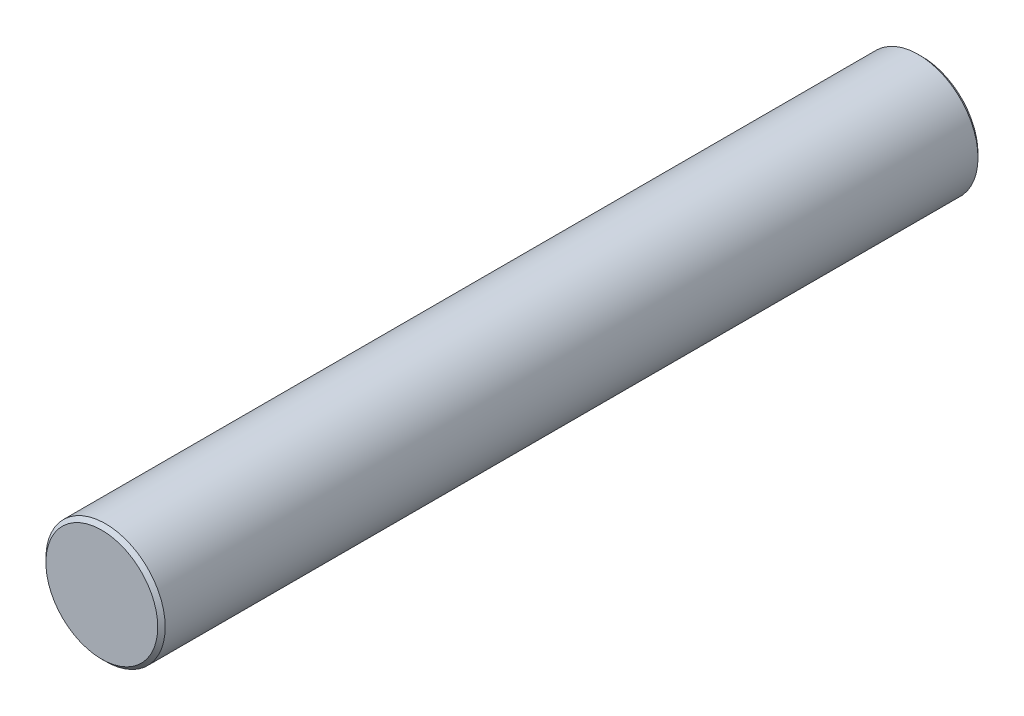
ISO-10303-21;
HEADER;
FILE_DESCRIPTION(('STEP AP214'),'2;1');
FILE_NAME('part.step','',(''),(''),'','','');
FILE_SCHEMA(('AUTOMOTIVE_DESIGN { 1 0 10303 214 1 1 1 1 }'));
ENDSEC;
DATA;
#1=APPLICATION_CONTEXT('core data for automotive mechanical design processes');
#2=APPLICATION_PROTOCOL_DEFINITION('international standard','automotive_design',2000,#1);
#3=PRODUCT_CONTEXT('',#1,'mechanical');
#4=PRODUCT('Part','Part','',(#3));
#5=PRODUCT_RELATED_PRODUCT_CATEGORY('part','',(#4));
#6=PRODUCT_DEFINITION_FORMATION('','',#4);
#7=PRODUCT_DEFINITION_CONTEXT('part definition',#1,'design');
#8=PRODUCT_DEFINITION('design','',#6,#7);
#9=PRODUCT_DEFINITION_SHAPE('','',#8);
#10=(LENGTH_UNIT() NAMED_UNIT(*) SI_UNIT(.MILLI.,.METRE.));
#11=(NAMED_UNIT(*) PLANE_ANGLE_UNIT() SI_UNIT($,.RADIAN.));
#12=(NAMED_UNIT(*) SI_UNIT($,.STERADIAN.) SOLID_ANGLE_UNIT());
#13=UNCERTAINTY_MEASURE_WITH_UNIT(LENGTH_MEASURE(1.E-05),#10,'distance_accuracy_value','');
#14=(GEOMETRIC_REPRESENTATION_CONTEXT(3) GLOBAL_UNCERTAINTY_ASSIGNED_CONTEXT((#13)) GLOBAL_UNIT_ASSIGNED_CONTEXT((#10,
#11,#12)) REPRESENTATION_CONTEXT('',''));
#15=CARTESIAN_POINT('',(0.,0.,0.));
#16=DIRECTION('',(0.,0.,1.));
#17=DIRECTION('',(1.,0.,0.));
#18=AXIS2_PLACEMENT_3D('',#15,#16,#17);
#19=CARTESIAN_POINT('',(-33.610628805,0.,55.));
#20=DIRECTION('',(0.,0.,-1.));
#21=DIRECTION('',(-1.,0.,0.));
#22=AXIS2_PLACEMENT_3D('',#19,#20,#21);
#23=CYLINDRICAL_SURFACE('',#22,8.00000000000001);
#24=CARTESIAN_POINT('',(-41.2891773767985,-2.24497034067952,48.4026196098586));
#25=CARTESIAN_POINT('',(-41.3204687050847,-2.13793919042912,48.2750508556962));
#26=CARTESIAN_POINT('',(-41.3524255672992,-2.02031474619086,48.1565549110275));
#27=CARTESIAN_POINT('',(-41.414241212432,-1.76653800619811,47.940762094698));
#28=CARTESIAN_POINT('',(-41.4441006114232,-1.63039118568655,47.8434589804289));
#29=CARTESIAN_POINT('',(-41.4985711947038,-1.34234083657794,47.6727508019051));
#30=CARTESIAN_POINT('',(-41.5231681730419,-1.1903962627548,47.5994101503956));
#31=CARTESIAN_POINT('',(-41.564199031048,-0.875170585825896,47.4797569209889));
#32=CARTESIAN_POINT('',(-41.5806361274108,-0.711893978881956,47.4334336913331));
#33=CARTESIAN_POINT('',(-41.6027988779069,-0.38763556682603,47.3714659893219));
#34=CARTESIAN_POINT('',(-41.6090309463019,-0.226966011589306,47.3543691034751));
#35=CARTESIAN_POINT('',(-41.6116828068893,0.0950450751442242,47.3470614357619));
#36=CARTESIAN_POINT('',(-41.6081050483967,0.256386428863146,47.3568439426572));
#37=CARTESIAN_POINT('',(-41.5919162091125,0.56772379887503,47.4018262019229));
#38=CARTESIAN_POINT('',(-41.5797079874793,0.717907116825453,47.4358929674807));
#39=CARTESIAN_POINT('',(-41.5479371538383,1.01033930953776,47.526884236615));
#40=CARTESIAN_POINT('',(-41.5283736904332,1.15258726356116,47.5838113864201));
#41=CARTESIAN_POINT('',(-41.4831243690139,1.42972242723955,47.7205846423869));
#42=CARTESIAN_POINT('',(-41.4572787730546,1.56428078209791,47.8010421804193));
#43=CARTESIAN_POINT('',(-41.4022759218393,1.81856776702252,47.9818182083398));
#44=CARTESIAN_POINT('',(-41.3731174793567,1.93829104829739,48.0821438279944));
#45=CARTESIAN_POINT('',(-41.3122725377233,2.16788337233966,48.307446819748));
#46=CARTESIAN_POINT('',(-41.2805465784894,2.27657322418578,48.433617421161));
#47=CARTESIAN_POINT('',(-41.2198606840384,2.47185661189762,48.7026657461835));
#48=CARTESIAN_POINT('',(-41.1909013214422,2.55844557956851,48.845546914938));
#49=CARTESIAN_POINT('',(-41.1384346832288,2.70899898259065,49.1481454706392));
#50=CARTESIAN_POINT('',(-41.1150741350813,2.77237369813639,49.3081834533896));
#51=CARTESIAN_POINT('',(-41.0777712852999,2.87134479223996,49.637655523364));
#52=CARTESIAN_POINT('',(-41.0638247602852,2.90695362842253,49.8070853601864));
#53=CARTESIAN_POINT('',(-41.0476656714241,2.94804146003936,50.1422363457774));
#54=CARTESIAN_POINT('',(-41.0449465799531,2.95482151162055,50.3077737897043));
#55=CARTESIAN_POINT('',(-41.0502070154145,2.94155179885308,50.6375812462188));
#56=CARTESIAN_POINT('',(-41.0581852396711,2.92150530133362,50.8018514106805));
#57=CARTESIAN_POINT('',(-41.0833947706818,2.85638208381296,51.1193300891844));
#58=CARTESIAN_POINT('',(-41.1003378321572,2.81208367236827,51.2727230186779));
#59=CARTESIAN_POINT('',(-41.1413087638498,2.70043977145201,51.5698649261916));
#60=CARTESIAN_POINT('',(-41.1653382325662,2.63308908146767,51.7136117193179));
#61=CARTESIAN_POINT('',(-41.2189397631446,2.47404531052235,51.9936227787521));
#62=CARTESIAN_POINT('',(-41.248694113262,2.38149136065889,52.1293628071604));
#63=CARTESIAN_POINT('',(-41.3098530013878,2.17565145475352,52.3837121269732));
#64=CARTESIAN_POINT('',(-41.3412580491566,2.06235906723167,52.5023160836032));
#65=CARTESIAN_POINT('',(-41.4037023310905,1.81251852801544,52.7238793676943));
#66=CARTESIAN_POINT('',(-41.4346746396574,1.67521146317903,52.8260053640328));
#67=CARTESIAN_POINT('',(-41.4913658328461,1.38416678497271,53.0052948009653));
#68=CARTESIAN_POINT('',(-41.5170859581959,1.23043306518826,53.0824641396136));
#69=CARTESIAN_POINT('',(-41.559550542838,0.915956648466314,53.2068664009787));
#70=CARTESIAN_POINT('',(-41.5765592282473,0.755603389010643,53.2549896684392));
#71=CARTESIAN_POINT('',(-41.6008350661672,0.428331647188945,53.323060064172));
#72=CARTESIAN_POINT('',(-41.6081071118696,0.261416505974415,53.3430213456475));
#73=CARTESIAN_POINT('',(-41.611916805897,-0.0624374120420378,53.3535127528464));
#74=CARTESIAN_POINT('',(-41.6091281212548,-0.219311384552947,53.3458898132852));
#75=CARTESIAN_POINT('',(-41.5946036809115,-0.529366582541286,53.305604168008));
#76=CARTESIAN_POINT('',(-41.5828683966596,-0.682548002162305,53.2729427817147));
#77=CARTESIAN_POINT('',(-41.5518594606401,-0.979218244793988,53.1843978927445));
#78=CARTESIAN_POINT('',(-41.5326754929989,-1.12279940737477,53.1287901877021));
#79=CARTESIAN_POINT('',(-41.4886302351023,-1.39880315445829,52.9962602272239));
#80=CARTESIAN_POINT('',(-41.463767619172,-1.53122312349363,52.919332993869));
#81=CARTESIAN_POINT('',(-41.4092022595512,-1.78901085087034,52.7415862966361));
#82=CARTESIAN_POINT('',(-41.3793088949093,-1.91359402274918,52.6396882223284));
#83=CARTESIAN_POINT('',(-41.3187284165575,-2.14464329096743,52.4172495914067));
#84=CARTESIAN_POINT('',(-41.2880409955556,-2.25110224887089,52.2967017248672));
#85=CARTESIAN_POINT('',(-41.2272923871667,-2.4490339733021,52.0324854978379));
#86=CARTESIAN_POINT('',(-41.1973639833782,-2.53932387713118,51.8878969524728));
#87=CARTESIAN_POINT('',(-41.1436079051226,-2.69462684220229,51.5846716556201));
#88=CARTESIAN_POINT('',(-41.1197794382431,-2.75964318717572,51.4260367324343));
#89=CARTESIAN_POINT('',(-41.0815139272662,-2.86161365628776,51.1010837023537));
#90=CARTESIAN_POINT('',(-41.0669628956127,-2.89890935509522,50.9348868433296));
#91=CARTESIAN_POINT('',(-41.0487636831902,-2.94530095184835,50.5980545254522));
#92=CARTESIAN_POINT('',(-41.0451104294384,-2.95440997094063,50.4274211691425));
#93=CARTESIAN_POINT('',(-41.0490951437728,-2.94435443540735,50.0960821302001));
#94=CARTESIAN_POINT('',(-41.0561536807227,-2.92664090036002,49.9353231599497));
#95=CARTESIAN_POINT('',(-41.0796087386878,-2.86624666434047,49.6192489642949));
#96=CARTESIAN_POINT('',(-41.0960087614107,-2.82355660061495,49.4639358034718));
#97=CARTESIAN_POINT('',(-41.1383256186343,-2.70885342103864,49.1469674309109));
#98=CARTESIAN_POINT('',(-41.1650627093231,-2.63422600333612,48.986366444177));
#99=CARTESIAN_POINT('',(-41.2240114976073,-2.45864545474999,48.6813586571926));
#100=CARTESIAN_POINT('',(-41.256225413035,-2.35768165009941,48.5369584569051));
#101=CARTESIAN_POINT('',(-41.2891773767985,-2.24497034067952,48.4026196098586));
#102=B_SPLINE_CURVE_WITH_KNOTS('',3,(#24,#25,#26,#27,#28,#29,#30,#31,#32,#33,#34,#35,#36,#37,
#38,#39,#40,#41,#42,#43,#44,#45,#46,#47,#48,#49,#50,#51,#52,#53,#54,#55,#56,#57,#58,#59,#60,#61,
#62,#63,#64,#65,#66,#67,#68,#69,#70,#71,#72,#73,#74,#75,#76,#77,#78,#79,#80,#81,#82,#83,#84,#85,
#86,#87,#88,#89,#90,#91,#92,#93,#94,#95,#96,#97,#98,#99,#100,#101),.UNSPECIFIED.,.T.,.F.,(4,2,2,
2,2,2,2,2,2,2,2,2,2,2,2,2,2,2,2,2,2,2,2,2,2,2,2,2,2,2,2,2,2,2,2,2,2,2,4),(0.,0.507702928896321,
1.01525610479895,1.52416260364591,2.03286832760257,2.51546760502325,2.99794639815864,
3.45927527984795,3.92065757856213,4.39529441991736,4.87010189687206,5.37638151484447,
5.88276569489637,6.4012436203587,6.91948878798846,7.41407924557598,7.90860947940856,
8.38812740412316,8.86775357777047,9.36643673757954,9.86527481364949,10.3844181320413,
10.9034386704938,11.4056135038279,11.9075358721108,12.3764918551694,12.8454231278825,
13.3088751802385,13.7724355358035,14.2614089468023,14.7505745024334,15.2673108687031,
15.7839800742283,16.2941722350107,16.8041268611119,17.287462608836,17.7709796569933,
18.3054095219995,18.8400563213503),.UNSPECIFIED.);
#103=CARTESIAN_POINT('',(-41.2891773767985,-2.24497034067952,48.4026196098586));
#104=VERTEX_POINT('',#103);
#105=EDGE_CURVE('E10',#104,#104,#102,.T.);
#106=ORIENTED_EDGE('',*,*,#105,.T.);
#107=EDGE_LOOP('',(#106));
#108=FACE_BOUND('',#107,.T.);
#109=CARTESIAN_POINT('',(-33.610628805,0.,-54.5));
#110=DIRECTION('',(0.,0.,1.));
#111=DIRECTION('',(1.,0.,0.));
#112=AXIS2_PLACEMENT_3D('',#109,#110,#111);
#113=CIRCLE('',#112,8.00000000000001);
#114=CARTESIAN_POINT('',(-25.610628805,0.,-54.5));
#115=VERTEX_POINT('',#114);
#116=EDGE_CURVE('E50',#115,#115,#113,.T.);
#117=ORIENTED_EDGE('',*,*,#116,.T.);
#118=EDGE_LOOP('',(#117));
#119=FACE_BOUND('',#118,.T.);
#120=CARTESIAN_POINT('',(-33.610628805,0.,54.5));
#121=DIRECTION('',(0.,0.,1.));
#122=DIRECTION('',(1.,0.,0.));
#123=AXIS2_PLACEMENT_3D('',#120,#121,#122);
#124=CIRCLE('',#123,8.00000000000001);
#125=CARTESIAN_POINT('',(-25.610628805,0.,54.5));
#126=VERTEX_POINT('',#125);
#127=EDGE_CURVE('E55',#126,#126,#124,.F.);
#128=ORIENTED_EDGE('',*,*,#127,.T.);
#129=EDGE_LOOP('',(#128));
#130=FACE_BOUND('',#129,.T.);
#131=ADVANCED_FACE('F31',(#108,#119,#130),#23,.T.);
#132=CARTESIAN_POINT('',(-33.610628805,0.,55.));
#133=DIRECTION('',(0.,0.,1.));
#134=DIRECTION('',(1.,0.,0.));
#135=AXIS2_PLACEMENT_3D('',#132,#133,#134);
#136=PLANE('',#135);
#137=CARTESIAN_POINT('',(-33.610628805,0.,55.));
#138=DIRECTION('',(0.,0.,1.));
#139=DIRECTION('',(1.,0.,0.));
#140=AXIS2_PLACEMENT_3D('',#137,#138,#139);
#141=CIRCLE('',#140,7.50000000000001);
#142=CARTESIAN_POINT('',(-26.110628805,0.,55.));
#143=VERTEX_POINT('',#142);
#144=EDGE_CURVE('E42',#143,#143,#141,.T.);
#145=ORIENTED_EDGE('',*,*,#144,.T.);
#146=EDGE_LOOP('',(#145));
#147=FACE_BOUND('',#146,.T.);
#148=ADVANCED_FACE('F77',(#147),#136,.T.);
#149=CARTESIAN_POINT('',(-33.610628805,0.,-55.));
#150=DIRECTION('',(0.,0.,1.));
#151=DIRECTION('',(1.,0.,0.));
#152=AXIS2_PLACEMENT_3D('',#149,#150,#151);
#153=PLANE('',#152);
#154=CARTESIAN_POINT('',(-33.610628805,0.,-55.));
#155=DIRECTION('',(0.,0.,1.));
#156=DIRECTION('',(1.,0.,0.));
#157=AXIS2_PLACEMENT_3D('',#154,#155,#156);
#158=CIRCLE('',#157,7.50000000000002);
#159=CARTESIAN_POINT('',(-26.110628805,0.,-55.));
#160=VERTEX_POINT('',#159);
#161=EDGE_CURVE('E46',#160,#160,#158,.F.);
#162=ORIENTED_EDGE('',*,*,#161,.T.);
#163=EDGE_LOOP('',(#162));
#164=FACE_BOUND('',#163,.T.);
#165=ADVANCED_FACE('F81',(#164),#153,.F.);
#166=CARTESIAN_POINT('',(-33.610628805,0.,-54.5));
#167=DIRECTION('',(0.,0.,1.));
#168=DIRECTION('',(1.,0.,0.));
#169=AXIS2_PLACEMENT_3D('',#166,#167,#168);
#170=CONICAL_SURFACE('',#169,8.00000000000001,0.785398163397433);
#171=ORIENTED_EDGE('',*,*,#161,.F.);
#172=EDGE_LOOP('',(#171));
#173=FACE_BOUND('',#172,.T.);
#174=ORIENTED_EDGE('',*,*,#116,.F.);
#175=EDGE_LOOP('',(#174));
#176=FACE_BOUND('',#175,.T.);
#177=ADVANCED_FACE('F72',(#173,#176),#170,.T.);
#178=CARTESIAN_POINT('',(-33.610628805,0.,55.));
#179=DIRECTION('',(0.,0.,-1.));
#180=DIRECTION('',(-1.,0.,0.));
#181=AXIS2_PLACEMENT_3D('',#178,#179,#180);
#182=CONICAL_SURFACE('',#181,7.50000000000001,0.78539816339746);
#183=ORIENTED_EDGE('',*,*,#127,.F.);
#184=EDGE_LOOP('',(#183));
#185=FACE_BOUND('',#184,.T.);
#186=ORIENTED_EDGE('',*,*,#144,.F.);
#187=EDGE_LOOP('',(#186));
#188=FACE_BOUND('',#187,.T.);
#189=ADVANCED_FACE('F33',(#185,#188),#182,.T.);
#190=CARTESIAN_POINT('',(-41.610628805,0.,50.3499662553128));
#191=DIRECTION('',(-1.,0.,0.));
#192=DIRECTION('',(0.,0.,1.));
#193=AXIS2_PLACEMENT_3D('',#190,#191,#192);
#194=CONICAL_SURFACE('',#193,3.,0.0872664625997167);
#195=CARTESIAN_POINT('',(-31.610628805,0.,50.3499662553128));
#196=DIRECTION('',(-1.,0.,0.));
#197=DIRECTION('',(0.,0.,1.));
#198=AXIS2_PLACEMENT_3D('',#195,#196,#197);
#199=CIRCLE('',#198,2.12511336474076);
#200=CARTESIAN_POINT('',(-31.610628805,0.,52.4750796200536));
#201=VERTEX_POINT('',#200);
#202=EDGE_CURVE('E58',#201,#201,#199,.T.);
#203=ORIENTED_EDGE('',*,*,#202,.F.);
#204=EDGE_LOOP('',(#203));
#205=FACE_BOUND('',#204,.T.);
#206=ORIENTED_EDGE('',*,*,#105,.F.);
#207=EDGE_LOOP('',(#206));
#208=FACE_BOUND('',#207,.T.);
#209=ADVANCED_FACE('F64',(#205,#208),#194,.F.);
#210=CARTESIAN_POINT('',(-31.610628805,0.,50.3499662553128));
#211=DIRECTION('',(-1.,0.,0.));
#212=DIRECTION('',(0.,0.,1.));
#213=AXIS2_PLACEMENT_3D('',#210,#211,#212);
#214=PLANE('',#213);
#215=ORIENTED_EDGE('',*,*,#202,.T.);
#216=EDGE_LOOP('',(#215));
#217=FACE_BOUND('',#216,.T.);
#218=ADVANCED_FACE('F62',(#217),#214,.T.);
#219=CLOSED_SHELL('',(#131,#148,#165,#177,#189,#209,#218));
#220=MANIFOLD_SOLID_BREP('B2',#219);
#221=ADVANCED_BREP_SHAPE_REPRESENTATION('',(#18,#220),#14);
#222=SHAPE_DEFINITION_REPRESENTATION(#9,#221);
ENDSEC;
END-ISO-10303-21;
